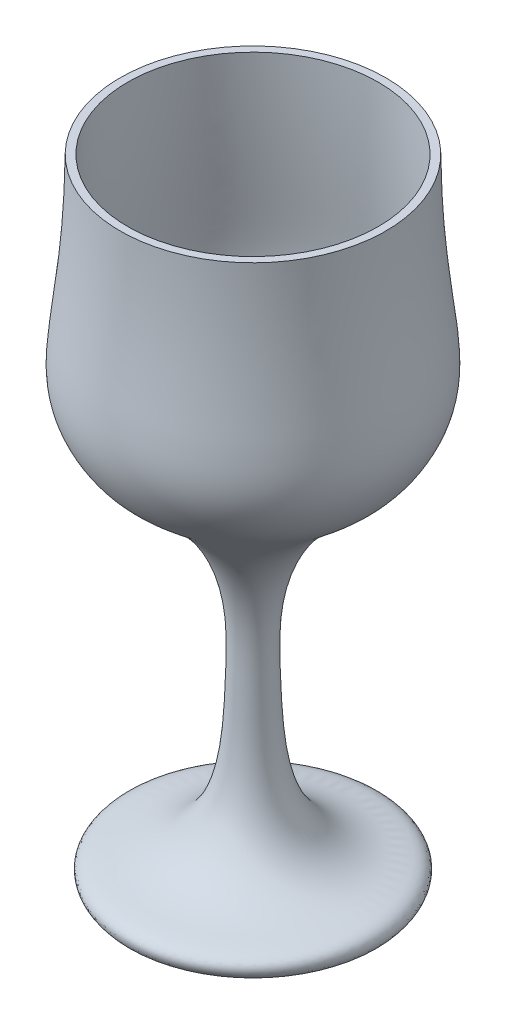
ISO-10303-21;
HEADER;
FILE_DESCRIPTION(('STEP AP214'),'2;1');
FILE_NAME('part.step','',(''),(''),'','','');
FILE_SCHEMA(('AUTOMOTIVE_DESIGN { 1 0 10303 214 1 1 1 1 }'));
ENDSEC;
DATA;
#1=APPLICATION_CONTEXT('core data for automotive mechanical design processes');
#2=APPLICATION_PROTOCOL_DEFINITION('international standard','automotive_design',2000,#1);
#3=PRODUCT_CONTEXT('',#1,'mechanical');
#4=PRODUCT('Part','Part','',(#3));
#5=PRODUCT_RELATED_PRODUCT_CATEGORY('part','',(#4));
#6=PRODUCT_DEFINITION_FORMATION('','',#4);
#7=PRODUCT_DEFINITION_CONTEXT('part definition',#1,'design');
#8=PRODUCT_DEFINITION('design','',#6,#7);
#9=PRODUCT_DEFINITION_SHAPE('','',#8);
#10=(LENGTH_UNIT() NAMED_UNIT(*) SI_UNIT(.MILLI.,.METRE.));
#11=(NAMED_UNIT(*) PLANE_ANGLE_UNIT() SI_UNIT($,.RADIAN.));
#12=(NAMED_UNIT(*) SI_UNIT($,.STERADIAN.) SOLID_ANGLE_UNIT());
#13=UNCERTAINTY_MEASURE_WITH_UNIT(LENGTH_MEASURE(1.E-05),#10,'distance_accuracy_value','');
#14=(GEOMETRIC_REPRESENTATION_CONTEXT(3) GLOBAL_UNCERTAINTY_ASSIGNED_CONTEXT((#13)) GLOBAL_UNIT_ASSIGNED_CONTEXT((#10,
#11,#12)) REPRESENTATION_CONTEXT('',''));
#15=CARTESIAN_POINT('',(0.,0.,0.));
#16=DIRECTION('',(0.,0.,1.));
#17=DIRECTION('',(1.,0.,0.));
#18=AXIS2_PLACEMENT_3D('',#15,#16,#17);
#19=CARTESIAN_POINT('',(33.,165.000000000001,0.));
#20=CARTESIAN_POINT('',(33.4367048494482,126.162453137051,0.));
#21=CARTESIAN_POINT('',(39.775977313878,114.89870532339,0.));
#22=CARTESIAN_POINT('',(27.9848392659418,95.2408342300408,0.));
#23=CARTESIAN_POINT('',(6.28577775674371,78.1851392334272,0.));
#24=CARTESIAN_POINT('',(0.,77.0201414920746,0.));
#25=B_SPLINE_CURVE_WITH_KNOTS('',3,(#19,#20,#21,#22,#23,#24),.UNSPECIFIED.,.F.,.F.,(4,1,1,4),
(0.299210169117043,0.726878075069933,0.796957058158228,1.),.UNSPECIFIED.);
#26=CARTESIAN_POINT('',(0.,0.,0.));
#27=DIRECTION('',(0.,-1.,0.));
#28=AXIS1_PLACEMENT('',#26,#27);
#29=SURFACE_OF_REVOLUTION('',#25,#28);
#30=CARTESIAN_POINT('',(0.,77.0201414920746,0.));
#31=VERTEX_POINT('',#30);
#32=VERTEX_LOOP('',#31);
#33=FACE_BOUND('',#32,.T.);
#34=CARTESIAN_POINT('',(0.,165.,0.));
#35=DIRECTION('',(0.,-1.,0.));
#36=DIRECTION('',(0.,0.,-1.));
#37=AXIS2_PLACEMENT_3D('',#34,#35,#36);
#38=CIRCLE('',#37,33.);
#39=CARTESIAN_POINT('',(0.,165.,-33.));
#40=VERTEX_POINT('',#39);
#41=EDGE_CURVE('E11',#40,#40,#38,.T.);
#42=ORIENTED_EDGE('',*,*,#41,.F.);
#43=EDGE_LOOP('',(#42));
#44=FACE_BOUND('',#43,.T.);
#45=ADVANCED_FACE('F36',(#33,#44),#29,.F.);
#46=CARTESIAN_POINT('',(35.,165.,0.));
#47=DIRECTION('',(0.,1.,0.));
#48=DIRECTION('',(0.,0.,1.));
#49=AXIS2_PLACEMENT_3D('',#46,#47,#48);
#50=PLANE('',#49);
#51=ORIENTED_EDGE('',*,*,#41,.T.);
#52=EDGE_LOOP('',(#51));
#53=FACE_BOUND('',#52,.T.);
#54=CARTESIAN_POINT('',(0.,165.,0.));
#55=DIRECTION('',(0.,-1.,0.));
#56=DIRECTION('',(0.,0.,-1.));
#57=AXIS2_PLACEMENT_3D('',#54,#55,#56);
#58=CIRCLE('',#57,35.);
#59=CARTESIAN_POINT('',(0.,165.,-35.));
#60=VERTEX_POINT('',#59);
#61=EDGE_CURVE('E44',#60,#60,#58,.T.);
#62=ORIENTED_EDGE('',*,*,#61,.F.);
#63=EDGE_LOOP('',(#62));
#64=FACE_BOUND('',#63,.T.);
#65=ADVANCED_FACE('F49',(#53,#64),#50,.T.);
#66=CARTESIAN_POINT('',(32.5,0.,0.));
#67=CARTESIAN_POINT('',(33.5896237015002,1.35306974401144,0.));
#68=CARTESIAN_POINT('',(33.1376417035568,4.58739277572927,0.));
#69=CARTESIAN_POINT('',(7.2558388245879,6.63734596842894,0.));
#70=CARTESIAN_POINT('',(5.47969522214925,31.5582462776898,0.));
#71=CARTESIAN_POINT('',(4.06887769078228,81.7964448246568,0.));
#72=CARTESIAN_POINT('',(27.7426443929461,92.0918230668648,0.));
#73=CARTESIAN_POINT('',(43.5051947695983,116.826103657944,0.));
#74=CARTESIAN_POINT('',(35.4367048494482,126.162453137051,0.));
#75=CARTESIAN_POINT('',(35.,165.,0.));
#76=B_SPLINE_CURVE_WITH_KNOTS('',3,(#66,#67,#68,#69,#70,#71,#72,#73,#74,#75),.UNSPECIFIED.,.F.,
.F.,(4,1,1,1,1,1,1,4),(0.,0.0120642109938422,0.033714443109494,0.19619255692907,
0.247333432823878,0.493982326162762,0.572332094047111,1.),.UNSPECIFIED.);
#77=CARTESIAN_POINT('',(0.,0.,0.));
#78=DIRECTION('',(0.,-1.,0.));
#79=AXIS1_PLACEMENT('',#77,#78);
#80=SURFACE_OF_REVOLUTION('',#76,#79);
#81=ORIENTED_EDGE('',*,*,#61,.T.);
#82=EDGE_LOOP('',(#81));
#83=FACE_BOUND('',#82,.T.);
#84=CARTESIAN_POINT('',(0.,0.,0.));
#85=DIRECTION('',(0.,-1.,0.));
#86=DIRECTION('',(0.,0.,-1.));
#87=AXIS2_PLACEMENT_3D('',#84,#85,#86);
#88=CIRCLE('',#87,32.5);
#89=CARTESIAN_POINT('',(0.,0.,-32.5));
#90=VERTEX_POINT('',#89);
#91=EDGE_CURVE('E59',#90,#90,#88,.T.);
#92=ORIENTED_EDGE('',*,*,#91,.F.);
#93=EDGE_LOOP('',(#92));
#94=FACE_BOUND('',#93,.T.);
#95=ADVANCED_FACE('F54',(#83,#94),#80,.F.);
#96=CARTESIAN_POINT('',(0.,0.,0.));
#97=DIRECTION('',(0.,-1.,0.));
#98=DIRECTION('',(0.,0.,-1.));
#99=AXIS2_PLACEMENT_3D('',#96,#97,#98);
#100=PLANE('',#99);
#101=ORIENTED_EDGE('',*,*,#91,.T.);
#102=EDGE_LOOP('',(#101));
#103=FACE_BOUND('',#102,.T.);
#104=ADVANCED_FACE('F79',(#103),#100,.T.);
#105=CLOSED_SHELL('',(#45,#65,#95,#104));
#106=MANIFOLD_SOLID_BREP('B2',#105);
#107=ADVANCED_BREP_SHAPE_REPRESENTATION('',(#18,#106),#14);
#108=SHAPE_DEFINITION_REPRESENTATION(#9,#107);
ENDSEC;
END-ISO-10303-21;
